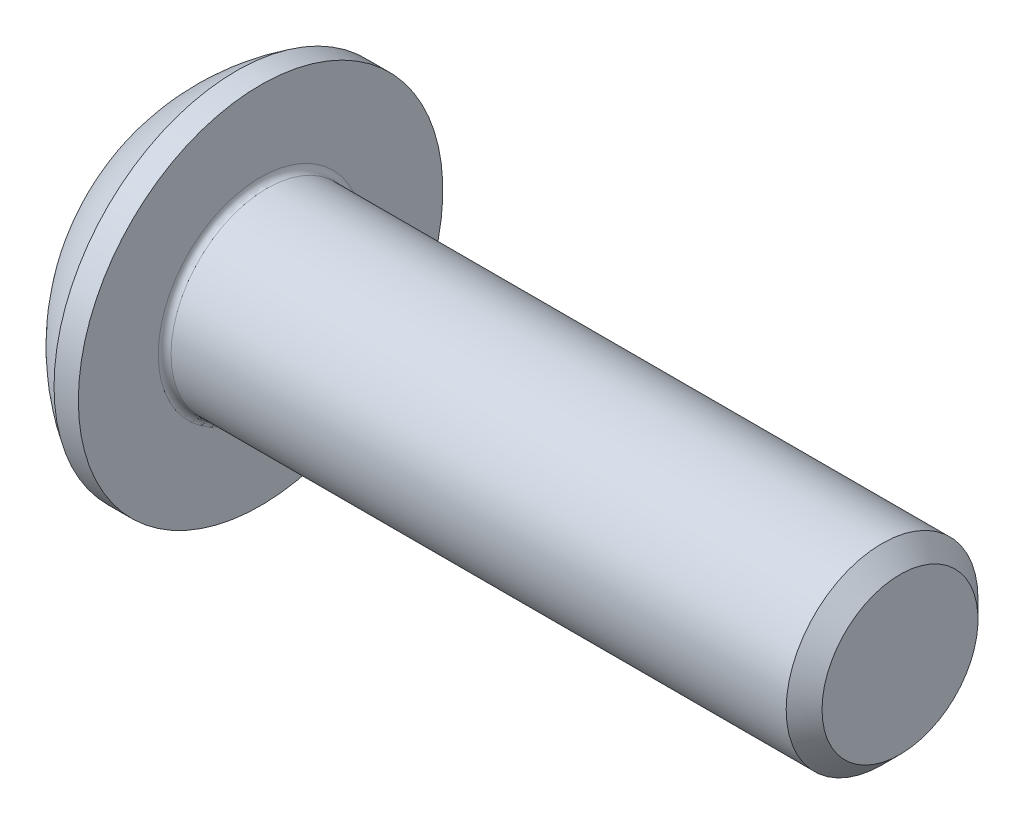
ISO-10303-21;
HEADER;
FILE_DESCRIPTION(('STEP AP214'),'2;1');
FILE_NAME('part.step','',(''),(''),'','','');
FILE_SCHEMA(('AUTOMOTIVE_DESIGN { 1 0 10303 214 1 1 1 1 }'));
ENDSEC;
DATA;
#1=APPLICATION_CONTEXT('core data for automotive mechanical design processes');
#2=APPLICATION_PROTOCOL_DEFINITION('international standard','automotive_design',2000,#1);
#3=PRODUCT_CONTEXT('',#1,'mechanical');
#4=PRODUCT('Part','Part','',(#3));
#5=PRODUCT_RELATED_PRODUCT_CATEGORY('part','',(#4));
#6=PRODUCT_DEFINITION_FORMATION('','',#4);
#7=PRODUCT_DEFINITION_CONTEXT('part definition',#1,'design');
#8=PRODUCT_DEFINITION('design','',#6,#7);
#9=PRODUCT_DEFINITION_SHAPE('','',#8);
#10=(LENGTH_UNIT() NAMED_UNIT(*) SI_UNIT(.MILLI.,.METRE.));
#11=(NAMED_UNIT(*) PLANE_ANGLE_UNIT() SI_UNIT($,.RADIAN.));
#12=(NAMED_UNIT(*) SI_UNIT($,.STERADIAN.) SOLID_ANGLE_UNIT());
#13=UNCERTAINTY_MEASURE_WITH_UNIT(LENGTH_MEASURE(1.E-05),#10,'distance_accuracy_value','');
#14=(GEOMETRIC_REPRESENTATION_CONTEXT(3) GLOBAL_UNCERTAINTY_ASSIGNED_CONTEXT((#13)) GLOBAL_UNIT_ASSIGNED_CONTEXT((#10,
#11,#12)) REPRESENTATION_CONTEXT('',''));
#15=CARTESIAN_POINT('',(0.,0.,0.));
#16=DIRECTION('',(0.,0.,1.));
#17=DIRECTION('',(1.,0.,0.));
#18=AXIS2_PLACEMENT_3D('',#15,#16,#17);
#19=CARTESIAN_POINT('',(0.,0.,0.));
#20=DIRECTION('',(-1.,0.,0.));
#21=DIRECTION('',(0.,0.,1.));
#22=AXIS2_PLACEMENT_3D('',#19,#20,#21);
#23=PLANE('',#22);
#24=CARTESIAN_POINT('',(0.,0.,0.));
#25=DIRECTION('',(-1.,0.,0.));
#26=DIRECTION('',(0.,0.,1.));
#27=AXIS2_PLACEMENT_3D('',#24,#25,#26);
#28=CIRCLE('',#27,1.425);
#29=CARTESIAN_POINT('',(0.,0.,1.425));
#30=VERTEX_POINT('',#29);
#31=EDGE_CURVE('E153',#30,#30,#28,.T.);
#32=ORIENTED_EDGE('',*,*,#31,.T.);
#33=EDGE_LOOP('',(#32));
#34=FACE_BOUND('',#33,.T.);
#35=DIRECTION('',(0.,-1.,0.));
#36=VECTOR('',#35,1.);
#37=CARTESIAN_POINT('',(0.,-0.577350269189625,0.999999999999998));
#38=LINE('',#37,#36);
#39=CARTESIAN_POINT('',(0.,0.577350269189628,1.));
#40=VERTEX_POINT('',#39);
#41=CARTESIAN_POINT('',(0.,-0.577350269189625,0.999999999999998));
#42=VERTEX_POINT('',#41);
#43=EDGE_CURVE('E48',#40,#42,#38,.T.);
#44=ORIENTED_EDGE('',*,*,#43,.T.);
#45=DIRECTION('',(0.,-0.499999999999999,-0.866025403784439));
#46=VECTOR('',#45,1.);
#47=CARTESIAN_POINT('',(0.,-1.15470053837925,0.));
#48=LINE('',#47,#46);
#49=CARTESIAN_POINT('',(0.,-1.15470053837925,0.));
#50=VERTEX_POINT('',#49);
#51=EDGE_CURVE('E273',#42,#50,#48,.T.);
#52=ORIENTED_EDGE('',*,*,#51,.T.);
#53=DIRECTION('',(0.,0.499999999999997,-0.86602540378444));
#54=VECTOR('',#53,1.);
#55=CARTESIAN_POINT('',(0.,-0.577350269189626,-1.));
#56=LINE('',#55,#54);
#57=CARTESIAN_POINT('',(0.,-0.577350269189626,-1.));
#58=VERTEX_POINT('',#57);
#59=EDGE_CURVE('E128',#50,#58,#56,.T.);
#60=ORIENTED_EDGE('',*,*,#59,.T.);
#61=DIRECTION('',(0.,1.,0.));
#62=VECTOR('',#61,1.);
#63=CARTESIAN_POINT('',(0.,0.577350269189628,-1.));
#64=LINE('',#63,#62);
#65=CARTESIAN_POINT('',(0.,0.577350269189628,-1.));
#66=VERTEX_POINT('',#65);
#67=EDGE_CURVE('E276',#58,#66,#64,.T.);
#68=ORIENTED_EDGE('',*,*,#67,.T.);
#69=DIRECTION('',(0.,0.499999999999999,0.866025403784439));
#70=VECTOR('',#69,1.);
#71=CARTESIAN_POINT('',(0.,1.15470053837925,0.));
#72=LINE('',#71,#70);
#73=CARTESIAN_POINT('',(0.,1.15470053837925,0.));
#74=VERTEX_POINT('',#73);
#75=EDGE_CURVE('E278',#66,#74,#72,.T.);
#76=ORIENTED_EDGE('',*,*,#75,.T.);
#77=DIRECTION('',(0.,-0.499999999999998,0.866025403784439));
#78=VECTOR('',#77,1.);
#79=CARTESIAN_POINT('',(0.,0.577350269189628,1.));
#80=LINE('',#79,#78);
#81=EDGE_CURVE('E280',#74,#40,#80,.T.);
#82=ORIENTED_EDGE('',*,*,#81,.T.);
#83=EDGE_LOOP('',(#44,#52,#60,#68,#76,#82));
#84=FACE_BOUND('',#83,.T.);
#85=ADVANCED_FACE('F33',(#34,#84),#23,.T.);
#86=CARTESIAN_POINT('',(3.03337598425198,0.,0.));
#87=DIRECTION('',(-1.,0.,0.));
#88=DIRECTION('',(0.,1.,0.));
#89=AXIS2_PLACEMENT_3D('',#86,#87,#88);
#90=SPHERICAL_SURFACE('',#89,3.35141684393879);
#91=CARTESIAN_POINT('',(1.27,0.,0.));
#92=DIRECTION('',(-1.,0.,0.));
#93=DIRECTION('',(0.,0.,1.));
#94=AXIS2_PLACEMENT_3D('',#91,#92,#93);
#95=CIRCLE('',#94,2.85);
#96=CARTESIAN_POINT('',(1.27,0.,2.85));
#97=VERTEX_POINT('',#96);
#98=EDGE_CURVE('E150',#97,#97,#95,.T.);
#99=ORIENTED_EDGE('',*,*,#98,.T.);
#100=EDGE_LOOP('',(#99));
#101=FACE_BOUND('',#100,.T.);
#102=ORIENTED_EDGE('',*,*,#31,.F.);
#103=EDGE_LOOP('',(#102));
#104=FACE_BOUND('',#103,.T.);
#105=ADVANCED_FACE('F174',(#101,#104),#90,.T.);
#106=CARTESIAN_POINT('',(0.,0.,0.));
#107=DIRECTION('',(-1.,0.,0.));
#108=DIRECTION('',(0.,0.,1.));
#109=AXIS2_PLACEMENT_3D('',#106,#107,#108);
#110=CYLINDRICAL_SURFACE('',#109,2.85);
#111=ORIENTED_EDGE('',*,*,#98,.F.);
#112=EDGE_LOOP('',(#111));
#113=FACE_BOUND('',#112,.T.);
#114=CARTESIAN_POINT('',(1.65,0.,0.));
#115=DIRECTION('',(-1.,0.,0.));
#116=DIRECTION('',(0.,0.,1.));
#117=AXIS2_PLACEMENT_3D('',#114,#115,#116);
#118=CIRCLE('',#117,2.85);
#119=CARTESIAN_POINT('',(1.65,0.,2.85));
#120=VERTEX_POINT('',#119);
#121=EDGE_CURVE('E147',#120,#120,#118,.T.);
#122=ORIENTED_EDGE('',*,*,#121,.T.);
#123=EDGE_LOOP('',(#122));
#124=FACE_BOUND('',#123,.T.);
#125=ADVANCED_FACE('F179',(#113,#124),#110,.T.);
#126=CARTESIAN_POINT('',(1.65,1.49999999999999,0.));
#127=DIRECTION('',(-1.,0.,0.));
#128=DIRECTION('',(0.,0.,1.));
#129=AXIS2_PLACEMENT_3D('',#126,#127,#128);
#130=PLANE('',#129);
#131=CARTESIAN_POINT('',(1.65,0.,0.));
#132=DIRECTION('',(-1.,0.,0.));
#133=DIRECTION('',(0.,0.,1.));
#134=AXIS2_PLACEMENT_3D('',#131,#132,#133);
#135=CIRCLE('',#134,1.6);
#136=CARTESIAN_POINT('',(1.65,0.,1.6));
#137=VERTEX_POINT('',#136);
#138=EDGE_CURVE('E41',#137,#137,#135,.T.);
#139=ORIENTED_EDGE('',*,*,#138,.T.);
#140=EDGE_LOOP('',(#139));
#141=FACE_BOUND('',#140,.T.);
#142=ORIENTED_EDGE('',*,*,#121,.F.);
#143=EDGE_LOOP('',(#142));
#144=FACE_BOUND('',#143,.T.);
#145=ADVANCED_FACE('F158',(#141,#144),#130,.F.);
#146=CARTESIAN_POINT('',(0.,0.,0.));
#147=DIRECTION('',(-1.,0.,0.));
#148=DIRECTION('',(0.,0.,1.));
#149=AXIS2_PLACEMENT_3D('',#146,#147,#148);
#150=CYLINDRICAL_SURFACE('',#149,1.5);
#151=CARTESIAN_POINT('',(1.75,0.,0.));
#152=DIRECTION('',(-1.,0.,0.));
#153=DIRECTION('',(0.,0.,1.));
#154=AXIS2_PLACEMENT_3D('',#151,#152,#153);
#155=CIRCLE('',#154,1.5);
#156=CARTESIAN_POINT('',(1.75,0.,1.5));
#157=VERTEX_POINT('',#156);
#158=EDGE_CURVE('E11',#157,#157,#155,.F.);
#159=ORIENTED_EDGE('',*,*,#158,.T.);
#160=EDGE_LOOP('',(#159));
#161=FACE_BOUND('',#160,.T.);
#162=CARTESIAN_POINT('',(11.3695,0.,0.));
#163=DIRECTION('',(-1.,0.,0.));
#164=DIRECTION('',(0.,0.,1.));
#165=AXIS2_PLACEMENT_3D('',#162,#163,#164);
#166=CIRCLE('',#165,1.5);
#167=CARTESIAN_POINT('',(11.3695,0.,1.5));
#168=VERTEX_POINT('',#167);
#169=EDGE_CURVE('E144',#168,#168,#166,.T.);
#170=ORIENTED_EDGE('',*,*,#169,.T.);
#171=EDGE_LOOP('',(#170));
#172=FACE_BOUND('',#171,.T.);
#173=ADVANCED_FACE('F188',(#161,#172),#150,.T.);
#174=CARTESIAN_POINT('',(11.65,0.,0.));
#175=DIRECTION('',(-1.,0.,0.));
#176=DIRECTION('',(0.,0.,1.));
#177=AXIS2_PLACEMENT_3D('',#174,#175,#176);
#178=CONICAL_SURFACE('',#177,1.2195,0.78539816339745);
#179=ORIENTED_EDGE('',*,*,#169,.F.);
#180=EDGE_LOOP('',(#179));
#181=FACE_BOUND('',#180,.T.);
#182=CARTESIAN_POINT('',(11.65,0.,0.));
#183=DIRECTION('',(-1.,0.,0.));
#184=DIRECTION('',(0.,0.,1.));
#185=AXIS2_PLACEMENT_3D('',#182,#183,#184);
#186=CIRCLE('',#185,1.2195);
#187=CARTESIAN_POINT('',(11.65,0.,1.2195));
#188=VERTEX_POINT('',#187);
#189=EDGE_CURVE('E140',#188,#188,#186,.T.);
#190=ORIENTED_EDGE('',*,*,#189,.T.);
#191=EDGE_LOOP('',(#190));
#192=FACE_BOUND('',#191,.T.);
#193=ADVANCED_FACE('F169',(#181,#192),#178,.T.);
#194=CARTESIAN_POINT('',(11.65,0.,0.));
#195=DIRECTION('',(-1.,0.,0.));
#196=DIRECTION('',(0.,0.,1.));
#197=AXIS2_PLACEMENT_3D('',#194,#195,#196);
#198=PLANE('',#197);
#199=ORIENTED_EDGE('',*,*,#189,.F.);
#200=EDGE_LOOP('',(#199));
#201=FACE_BOUND('',#200,.T.);
#202=ADVANCED_FACE('F162',(#201),#198,.F.);
#203=CARTESIAN_POINT('',(1.75,0.,0.));
#204=DIRECTION('',(-1.,0.,0.));
#205=DIRECTION('',(0.,0.,1.));
#206=AXIS2_PLACEMENT_3D('',#203,#204,#205);
#207=TOROIDAL_SURFACE('',#206,1.6,0.1);
#208=ORIENTED_EDGE('',*,*,#158,.F.);
#209=EDGE_LOOP('',(#208));
#210=FACE_BOUND('',#209,.T.);
#211=ORIENTED_EDGE('',*,*,#138,.F.);
#212=EDGE_LOOP('',(#211));
#213=FACE_BOUND('',#212,.T.);
#214=ADVANCED_FACE('F35',(#210,#213),#207,.F.);
#215=CARTESIAN_POINT('',(1.04,-1.15470053837925,0.));
#216=DIRECTION('',(0.,0.866025403784439,-0.499999999999999));
#217=DIRECTION('',(0.,0.499999999999999,0.866025403784439));
#218=AXIS2_PLACEMENT_3D('',#215,#216,#217);
#219=PLANE('',#218);
#220=DIRECTION('',(0.,-0.499999999999999,-0.866025403784439));
#221=VECTOR('',#220,1.);
#222=CARTESIAN_POINT('',(1.04,-1.15470053837925,0.));
#223=LINE('',#222,#221);
#224=CARTESIAN_POINT('',(1.04,-0.577350269189625,0.999999999999998));
#225=VERTEX_POINT('',#224);
#226=CARTESIAN_POINT('',(1.04,-0.866025403784437,0.499999999999998));
#227=VERTEX_POINT('',#226);
#228=EDGE_CURVE('E114',#225,#227,#223,.T.);
#229=ORIENTED_EDGE('',*,*,#228,.T.);
#230=CARTESIAN_POINT('',(1.04,-1.15470053837925,0.));
#231=VERTEX_POINT('',#230);
#232=EDGE_CURVE('E109',#227,#231,#223,.T.);
#233=ORIENTED_EDGE('',*,*,#232,.T.);
#234=DIRECTION('',(-1.,0.,0.));
#235=VECTOR('',#234,1.);
#236=CARTESIAN_POINT('',(1.04,-1.15470053837925,0.));
#237=LINE('',#236,#235);
#238=EDGE_CURVE('E111',#231,#50,#237,.T.);
#239=ORIENTED_EDGE('',*,*,#238,.T.);
#240=ORIENTED_EDGE('',*,*,#51,.F.);
#241=DIRECTION('',(-1.,0.,0.));
#242=VECTOR('',#241,1.);
#243=CARTESIAN_POINT('',(1.04,-0.577350269189625,0.999999999999998));
#244=LINE('',#243,#242);
#245=EDGE_CURVE('E269',#225,#42,#244,.T.);
#246=ORIENTED_EDGE('',*,*,#245,.F.);
#247=EDGE_LOOP('',(#229,#233,#239,#240,#246));
#248=FACE_BOUND('',#247,.T.);
#249=ADVANCED_FACE('F110',(#248),#219,.T.);
#250=CARTESIAN_POINT('',(1.04,-0.577350269189626,-1.));
#251=DIRECTION('',(0.,0.86602540378444,0.499999999999998));
#252=DIRECTION('',(0.,-0.499999999999998,0.86602540378444));
#253=AXIS2_PLACEMENT_3D('',#250,#251,#252);
#254=PLANE('',#253);
#255=DIRECTION('',(0.,0.499999999999997,-0.86602540378444));
#256=VECTOR('',#255,1.);
#257=CARTESIAN_POINT('',(1.04,-0.577350269189626,-1.));
#258=LINE('',#257,#256);
#259=CARTESIAN_POINT('',(1.04,-0.86602540378444,-0.499999999999997));
#260=VERTEX_POINT('',#259);
#261=EDGE_CURVE('E56',#231,#260,#258,.T.);
#262=ORIENTED_EDGE('',*,*,#261,.T.);
#263=CARTESIAN_POINT('',(1.04,-0.577350269189626,-1.));
#264=VERTEX_POINT('',#263);
#265=EDGE_CURVE('E123',#260,#264,#258,.T.);
#266=ORIENTED_EDGE('',*,*,#265,.T.);
#267=DIRECTION('',(-1.,0.,0.));
#268=VECTOR('',#267,1.);
#269=CARTESIAN_POINT('',(1.04,-0.577350269189626,-1.));
#270=LINE('',#269,#268);
#271=EDGE_CURVE('E130',#264,#58,#270,.T.);
#272=ORIENTED_EDGE('',*,*,#271,.T.);
#273=ORIENTED_EDGE('',*,*,#59,.F.);
#274=ORIENTED_EDGE('',*,*,#238,.F.);
#275=EDGE_LOOP('',(#262,#266,#272,#273,#274));
#276=FACE_BOUND('',#275,.T.);
#277=ADVANCED_FACE('F126',(#276),#254,.T.);
#278=CARTESIAN_POINT('',(1.04,0.577350269189628,-1.));
#279=DIRECTION('',(0.,0.,1.));
#280=DIRECTION('',(1.,0.,0.));
#281=AXIS2_PLACEMENT_3D('',#278,#279,#280);
#282=PLANE('',#281);
#283=DIRECTION('',(0.,1.,0.));
#284=VECTOR('',#283,1.);
#285=CARTESIAN_POINT('',(1.04,0.577350269189628,-1.));
#286=LINE('',#285,#284);
#287=CARTESIAN_POINT('',(1.04,0.,-1.));
#288=VERTEX_POINT('',#287);
#289=EDGE_CURVE('E250',#264,#288,#286,.T.);
#290=ORIENTED_EDGE('',*,*,#289,.T.);
#291=CARTESIAN_POINT('',(1.04,0.577350269189628,-1.));
#292=VERTEX_POINT('',#291);
#293=EDGE_CURVE('E122',#288,#292,#286,.T.);
#294=ORIENTED_EDGE('',*,*,#293,.T.);
#295=DIRECTION('',(-1.,0.,0.));
#296=VECTOR('',#295,1.);
#297=CARTESIAN_POINT('',(1.04,0.577350269189628,-1.));
#298=LINE('',#297,#296);
#299=EDGE_CURVE('E135',#292,#66,#298,.T.);
#300=ORIENTED_EDGE('',*,*,#299,.T.);
#301=ORIENTED_EDGE('',*,*,#67,.F.);
#302=ORIENTED_EDGE('',*,*,#271,.F.);
#303=EDGE_LOOP('',(#290,#294,#300,#301,#302));
#304=FACE_BOUND('',#303,.T.);
#305=ADVANCED_FACE('F202',(#304),#282,.T.);
#306=CARTESIAN_POINT('',(1.04,1.15470053837925,0.));
#307=DIRECTION('',(0.,-0.86602540378444,0.499999999999999));
#308=DIRECTION('',(0.,-0.499999999999999,-0.866025403784439));
#309=AXIS2_PLACEMENT_3D('',#306,#307,#308);
#310=PLANE('',#309);
#311=DIRECTION('',(0.,0.499999999999999,0.866025403784439));
#312=VECTOR('',#311,1.);
#313=CARTESIAN_POINT('',(1.04,1.15470053837925,0.));
#314=LINE('',#313,#312);
#315=CARTESIAN_POINT('',(1.04,0.86602540378444,-0.499999999999999));
#316=VERTEX_POINT('',#315);
#317=EDGE_CURVE('E239',#292,#316,#314,.T.);
#318=ORIENTED_EDGE('',*,*,#317,.T.);
#319=CARTESIAN_POINT('',(1.04,1.15470053837925,0.));
#320=VERTEX_POINT('',#319);
#321=EDGE_CURVE('E244',#316,#320,#314,.T.);
#322=ORIENTED_EDGE('',*,*,#321,.T.);
#323=DIRECTION('',(-1.,0.,0.));
#324=VECTOR('',#323,1.);
#325=CARTESIAN_POINT('',(1.04,1.15470053837925,0.));
#326=LINE('',#325,#324);
#327=EDGE_CURVE('E284',#320,#74,#326,.T.);
#328=ORIENTED_EDGE('',*,*,#327,.T.);
#329=ORIENTED_EDGE('',*,*,#75,.F.);
#330=ORIENTED_EDGE('',*,*,#299,.F.);
#331=EDGE_LOOP('',(#318,#322,#328,#329,#330));
#332=FACE_BOUND('',#331,.T.);
#333=ADVANCED_FACE('F205',(#332),#310,.T.);
#334=CARTESIAN_POINT('',(1.04,0.577350269189628,1.));
#335=DIRECTION('',(0.,-0.86602540378444,-0.499999999999998));
#336=DIRECTION('',(0.,0.499999999999998,-0.86602540378444));
#337=AXIS2_PLACEMENT_3D('',#334,#335,#336);
#338=PLANE('',#337);
#339=DIRECTION('',(0.,-0.499999999999998,0.866025403784439));
#340=VECTOR('',#339,1.);
#341=CARTESIAN_POINT('',(1.04,0.577350269189628,1.));
#342=LINE('',#341,#340);
#343=CARTESIAN_POINT('',(1.04,0.86602540378444,0.499999999999999));
#344=VERTEX_POINT('',#343);
#345=EDGE_CURVE('E247',#320,#344,#342,.T.);
#346=ORIENTED_EDGE('',*,*,#345,.T.);
#347=CARTESIAN_POINT('',(1.04,0.577350269189628,1.));
#348=VERTEX_POINT('',#347);
#349=EDGE_CURVE('E255',#344,#348,#342,.T.);
#350=ORIENTED_EDGE('',*,*,#349,.T.);
#351=DIRECTION('',(-1.,0.,0.));
#352=VECTOR('',#351,1.);
#353=CARTESIAN_POINT('',(1.04,0.577350269189628,1.));
#354=LINE('',#353,#352);
#355=EDGE_CURVE('E268',#348,#40,#354,.T.);
#356=ORIENTED_EDGE('',*,*,#355,.T.);
#357=ORIENTED_EDGE('',*,*,#81,.F.);
#358=ORIENTED_EDGE('',*,*,#327,.F.);
#359=EDGE_LOOP('',(#346,#350,#356,#357,#358));
#360=FACE_BOUND('',#359,.T.);
#361=ADVANCED_FACE('F209',(#360),#338,.T.);
#362=CARTESIAN_POINT('',(1.04,-0.577350269189625,0.999999999999998));
#363=DIRECTION('',(0.,0.,-1.));
#364=DIRECTION('',(0.,1.,0.));
#365=AXIS2_PLACEMENT_3D('',#362,#363,#364);
#366=PLANE('',#365);
#367=DIRECTION('',(0.,-1.,0.));
#368=VECTOR('',#367,1.);
#369=CARTESIAN_POINT('',(1.04,-0.577350269189625,0.999999999999998));
#370=LINE('',#369,#368);
#371=CARTESIAN_POINT('',(1.04,0.,1.));
#372=VERTEX_POINT('',#371);
#373=EDGE_CURVE('E261',#348,#372,#370,.T.);
#374=ORIENTED_EDGE('',*,*,#373,.T.);
#375=EDGE_CURVE('E263',#372,#225,#370,.T.);
#376=ORIENTED_EDGE('',*,*,#375,.T.);
#377=ORIENTED_EDGE('',*,*,#245,.T.);
#378=ORIENTED_EDGE('',*,*,#43,.F.);
#379=ORIENTED_EDGE('',*,*,#355,.F.);
#380=EDGE_LOOP('',(#374,#376,#377,#378,#379));
#381=FACE_BOUND('',#380,.T.);
#382=ADVANCED_FACE('F213',(#381),#366,.T.);
#383=CARTESIAN_POINT('',(1.04,-1.73205080756887,-1.));
#384=DIRECTION('',(1.,0.,0.));
#385=DIRECTION('',(0.,0.,-1.));
#386=AXIS2_PLACEMENT_3D('',#383,#384,#385);
#387=PLANE('',#386);
#388=CARTESIAN_POINT('',(1.04,0.,0.));
#389=DIRECTION('',(-1.,0.,0.));
#390=DIRECTION('',(0.,0.,1.));
#391=AXIS2_PLACEMENT_3D('',#388,#389,#390);
#392=CIRCLE('',#391,1.);
#393=EDGE_CURVE('E236',#316,#288,#392,.T.);
#394=ORIENTED_EDGE('',*,*,#393,.F.);
#395=ORIENTED_EDGE('',*,*,#317,.F.);
#396=ORIENTED_EDGE('',*,*,#293,.F.);
#397=EDGE_LOOP('',(#394,#395,#396));
#398=FACE_BOUND('',#397,.T.);
#399=ADVANCED_FACE('F217',(#398),#387,.F.);
#400=EDGE_CURVE('E141',#344,#316,#392,.T.);
#401=ORIENTED_EDGE('',*,*,#400,.F.);
#402=ORIENTED_EDGE('',*,*,#345,.F.);
#403=ORIENTED_EDGE('',*,*,#321,.F.);
#404=EDGE_LOOP('',(#401,#402,#403));
#405=FACE_BOUND('',#404,.T.);
#406=ADVANCED_FACE('F226',(#405),#387,.F.);
#407=EDGE_CURVE('E134',#372,#344,#392,.T.);
#408=ORIENTED_EDGE('',*,*,#407,.F.);
#409=ORIENTED_EDGE('',*,*,#373,.F.);
#410=ORIENTED_EDGE('',*,*,#349,.F.);
#411=EDGE_LOOP('',(#408,#409,#410));
#412=FACE_BOUND('',#411,.T.);
#413=ADVANCED_FACE('F231',(#412),#387,.F.);
#414=EDGE_CURVE('E129',#227,#372,#392,.T.);
#415=ORIENTED_EDGE('',*,*,#414,.F.);
#416=ORIENTED_EDGE('',*,*,#228,.F.);
#417=ORIENTED_EDGE('',*,*,#375,.F.);
#418=EDGE_LOOP('',(#415,#416,#417));
#419=FACE_BOUND('',#418,.T.);
#420=ADVANCED_FACE('F224',(#419),#387,.F.);
#421=EDGE_CURVE('E120',#260,#227,#392,.T.);
#422=ORIENTED_EDGE('',*,*,#421,.F.);
#423=ORIENTED_EDGE('',*,*,#261,.F.);
#424=ORIENTED_EDGE('',*,*,#232,.F.);
#425=EDGE_LOOP('',(#422,#423,#424));
#426=FACE_BOUND('',#425,.T.);
#427=ADVANCED_FACE('F119',(#426),#387,.F.);
#428=EDGE_CURVE('E242',#288,#260,#392,.T.);
#429=ORIENTED_EDGE('',*,*,#428,.F.);
#430=ORIENTED_EDGE('',*,*,#289,.F.);
#431=ORIENTED_EDGE('',*,*,#265,.F.);
#432=EDGE_LOOP('',(#429,#430,#431));
#433=FACE_BOUND('',#432,.T.);
#434=ADVANCED_FACE('F197',(#433),#387,.F.);
#435=CARTESIAN_POINT('',(1.61735026918963,0.,0.));
#436=DIRECTION('',(-1.,0.,0.));
#437=DIRECTION('',(0.,0.,1.));
#438=AXIS2_PLACEMENT_3D('',#435,#436,#437);
#439=CONICAL_SURFACE('',#438,0.,1.04719755119659);
#440=ORIENTED_EDGE('',*,*,#407,.T.);
#441=ORIENTED_EDGE('',*,*,#400,.T.);
#442=ORIENTED_EDGE('',*,*,#393,.T.);
#443=ORIENTED_EDGE('',*,*,#428,.T.);
#444=ORIENTED_EDGE('',*,*,#421,.T.);
#445=ORIENTED_EDGE('',*,*,#414,.T.);
#446=EDGE_LOOP('',(#440,#441,#442,#443,#444,#445));
#447=FACE_BOUND('',#446,.T.);
#448=CARTESIAN_POINT('',(1.61735026918963,0.,0.));
#449=VERTEX_POINT('',#448);
#450=VERTEX_LOOP('',#449);
#451=FACE_BOUND('',#450,.T.);
#452=ADVANCED_FACE('F195',(#447,#451),#439,.F.);
#453=CLOSED_SHELL('',(#85,#105,#125,#145,#173,#193,#202,#214,#249,#277,#305,#333,#361,#382,#399,
#406,#413,#420,#427,#434,#452));
#454=MANIFOLD_SOLID_BREP('B2',#453);
#455=ADVANCED_BREP_SHAPE_REPRESENTATION('',(#18,#454),#14);
#456=SHAPE_DEFINITION_REPRESENTATION(#9,#455);
ENDSEC;
END-ISO-10303-21;
